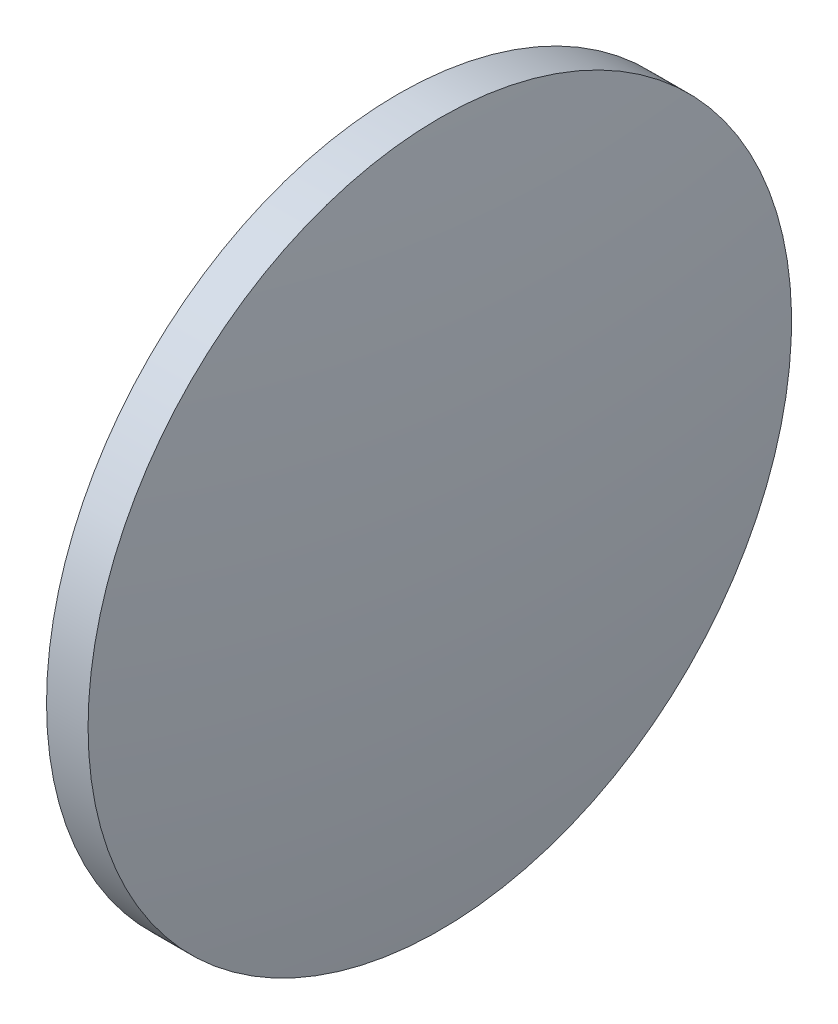
ISO-10303-21;
HEADER;
FILE_DESCRIPTION(('STEP AP214'),'2;1');
FILE_NAME('part.step','',(''),(''),'','','');
FILE_SCHEMA(('AUTOMOTIVE_DESIGN { 1 0 10303 214 1 1 1 1 }'));
ENDSEC;
DATA;
#1=APPLICATION_CONTEXT('core data for automotive mechanical design processes');
#2=APPLICATION_PROTOCOL_DEFINITION('international standard','automotive_design',2000,#1);
#3=PRODUCT_CONTEXT('',#1,'mechanical');
#4=PRODUCT('Part','Part','',(#3));
#5=PRODUCT_RELATED_PRODUCT_CATEGORY('part','',(#4));
#6=PRODUCT_DEFINITION_FORMATION('','',#4);
#7=PRODUCT_DEFINITION_CONTEXT('part definition',#1,'design');
#8=PRODUCT_DEFINITION('design','',#6,#7);
#9=PRODUCT_DEFINITION_SHAPE('','',#8);
#10=(LENGTH_UNIT() NAMED_UNIT(*) SI_UNIT(.MILLI.,.METRE.));
#11=(NAMED_UNIT(*) PLANE_ANGLE_UNIT() SI_UNIT($,.RADIAN.));
#12=(NAMED_UNIT(*) SI_UNIT($,.STERADIAN.) SOLID_ANGLE_UNIT());
#13=UNCERTAINTY_MEASURE_WITH_UNIT(LENGTH_MEASURE(1.E-05),#10,'distance_accuracy_value','');
#14=(GEOMETRIC_REPRESENTATION_CONTEXT(3) GLOBAL_UNCERTAINTY_ASSIGNED_CONTEXT((#13)) GLOBAL_UNIT_ASSIGNED_CONTEXT((#10,
#11,#12)) REPRESENTATION_CONTEXT('',''));
#15=CARTESIAN_POINT('',(0.,0.,0.));
#16=DIRECTION('',(0.,0.,1.));
#17=DIRECTION('',(1.,0.,0.));
#18=AXIS2_PLACEMENT_3D('',#15,#16,#17);
#19=CARTESIAN_POINT('',(354.874167735636,97.2322260463693,0.));
#20=DIRECTION('',(-1.,0.,0.));
#21=DIRECTION('',(0.,1.,0.));
#22=AXIS2_PLACEMENT_3D('',#19,#20,#21);
#23=SPHERICAL_SURFACE('',#22,185.207746472025);
#24=CARTESIAN_POINT('',(171.416408692182,97.2322260463696,0.));
#25=DIRECTION('',(-1.,0.,0.));
#26=DIRECTION('',(0.,0.,1.));
#27=AXIS2_PLACEMENT_3D('',#24,#25,#26);
#28=CIRCLE('',#27,25.4);
#29=CARTESIAN_POINT('',(171.416408692182,97.2322260463696,25.4));
#30=VERTEX_POINT('',#29);
#31=EDGE_CURVE('E46',#30,#30,#28,.T.);
#32=ORIENTED_EDGE('',*,*,#31,.T.);
#33=EDGE_LOOP('',(#32));
#34=FACE_BOUND('',#33,.T.);
#35=ADVANCED_FACE('F39',(#34),#23,.T.);
#36=CARTESIAN_POINT('',(-9.04139263699166,97.2322260463687,0.));
#37=DIRECTION('',(-1.,0.,0.));
#38=DIRECTION('',(0.,1.,0.));
#39=AXIS2_PLACEMENT_3D('',#36,#37,#38);
#40=SPHERICAL_SURFACE('',#39,185.207746472031);
#41=CARTESIAN_POINT('',(174.416366406468,97.2322260463696,0.));
#42=DIRECTION('',(-1.,0.,0.));
#43=DIRECTION('',(0.,0.,1.));
#44=AXIS2_PLACEMENT_3D('',#41,#42,#43);
#45=CIRCLE('',#44,25.4);
#46=CARTESIAN_POINT('',(174.416366406468,97.2322260463696,25.4));
#47=VERTEX_POINT('',#46);
#48=EDGE_CURVE('E10',#47,#47,#45,.T.);
#49=ORIENTED_EDGE('',*,*,#48,.F.);
#50=EDGE_LOOP('',(#49));
#51=FACE_BOUND('',#50,.T.);
#52=ADVANCED_FACE('F56',(#51),#40,.T.);
#53=CARTESIAN_POINT('',(165.744107942151,97.2322260463696,0.));
#54=DIRECTION('',(-1.,0.,0.));
#55=DIRECTION('',(0.,0.,1.));
#56=AXIS2_PLACEMENT_3D('',#53,#54,#55);
#57=CYLINDRICAL_SURFACE('',#56,25.4);
#58=ORIENTED_EDGE('',*,*,#48,.T.);
#59=EDGE_LOOP('',(#58));
#60=FACE_BOUND('',#59,.T.);
#61=ORIENTED_EDGE('',*,*,#31,.F.);
#62=EDGE_LOOP('',(#61));
#63=FACE_BOUND('',#62,.T.);
#64=ADVANCED_FACE('F54',(#60,#63),#57,.T.);
#65=CLOSED_SHELL('',(#35,#52,#64));
#66=MANIFOLD_SOLID_BREP('B2',#65);
#67=ADVANCED_BREP_SHAPE_REPRESENTATION('',(#18,#66),#14);
#68=SHAPE_DEFINITION_REPRESENTATION(#9,#67);
ENDSEC;
END-ISO-10303-21;
